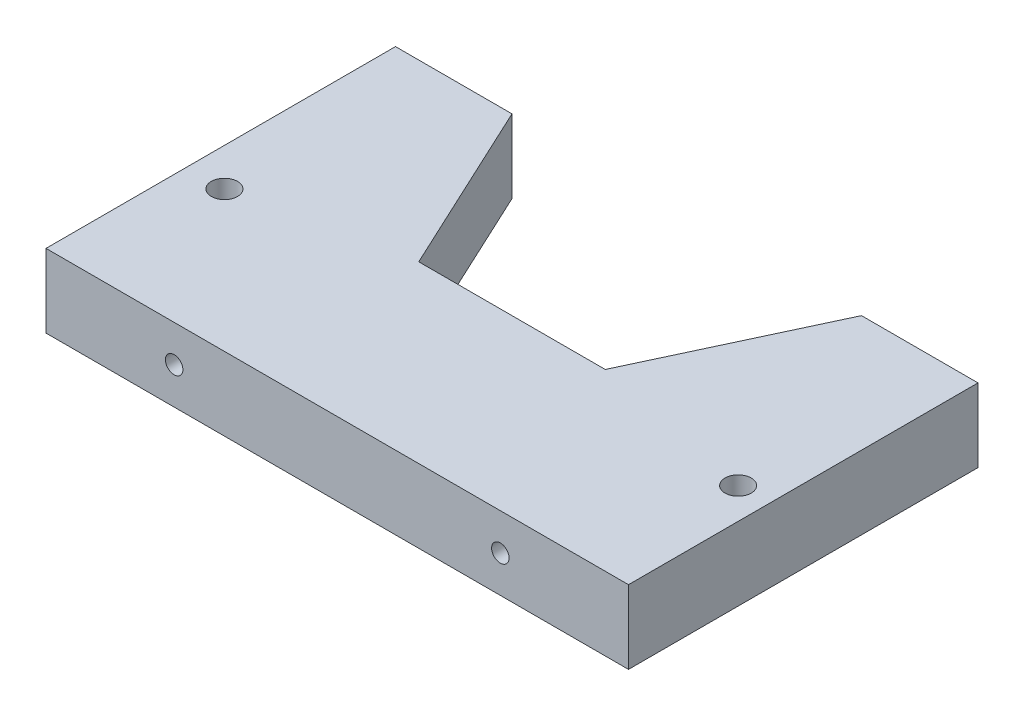
ISO-10303-21;
HEADER;
FILE_DESCRIPTION(('STEP AP214'),'2;1');
FILE_NAME('part.step','',(''),(''),'','','');
FILE_SCHEMA(('AUTOMOTIVE_DESIGN { 1 0 10303 214 1 1 1 1 }'));
ENDSEC;
DATA;
#1=APPLICATION_CONTEXT('core data for automotive mechanical design processes');
#2=APPLICATION_PROTOCOL_DEFINITION('international standard','automotive_design',2000,#1);
#3=PRODUCT_CONTEXT('',#1,'mechanical');
#4=PRODUCT('Part','Part','',(#3));
#5=PRODUCT_RELATED_PRODUCT_CATEGORY('part','',(#4));
#6=PRODUCT_DEFINITION_FORMATION('','',#4);
#7=PRODUCT_DEFINITION_CONTEXT('part definition',#1,'design');
#8=PRODUCT_DEFINITION('design','',#6,#7);
#9=PRODUCT_DEFINITION_SHAPE('','',#8);
#10=(LENGTH_UNIT() NAMED_UNIT(*) SI_UNIT(.MILLI.,.METRE.));
#11=(NAMED_UNIT(*) PLANE_ANGLE_UNIT() SI_UNIT($,.RADIAN.));
#12=(NAMED_UNIT(*) SI_UNIT($,.STERADIAN.) SOLID_ANGLE_UNIT());
#13=UNCERTAINTY_MEASURE_WITH_UNIT(LENGTH_MEASURE(1.E-05),#10,'distance_accuracy_value','');
#14=(GEOMETRIC_REPRESENTATION_CONTEXT(3) GLOBAL_UNCERTAINTY_ASSIGNED_CONTEXT((#13)) GLOBAL_UNIT_ASSIGNED_CONTEXT((#10,
#11,#12)) REPRESENTATION_CONTEXT('',''));
#15=CARTESIAN_POINT('',(0.,0.,0.));
#16=DIRECTION('',(0.,0.,1.));
#17=DIRECTION('',(1.,0.,0.));
#18=AXIS2_PLACEMENT_3D('',#15,#16,#17);
#19=CARTESIAN_POINT('',(50.,12.6,-30.));
#20=DIRECTION('',(-1.,0.,0.));
#21=DIRECTION('',(0.,0.,1.));
#22=AXIS2_PLACEMENT_3D('',#19,#20,#21);
#23=PLANE('',#22);
#24=DIRECTION('',(0.,0.,-1.));
#25=VECTOR('',#24,1.);
#26=CARTESIAN_POINT('',(50.,0.,-30.));
#27=LINE('',#26,#25);
#28=CARTESIAN_POINT('',(50.,0.,30.));
#29=VERTEX_POINT('',#28);
#30=CARTESIAN_POINT('',(50.,0.,-30.));
#31=VERTEX_POINT('',#30);
#32=EDGE_CURVE('E134',#29,#31,#27,.T.);
#33=ORIENTED_EDGE('',*,*,#32,.T.);
#34=DIRECTION('',(0.,-1.,0.));
#35=VECTOR('',#34,1.);
#36=CARTESIAN_POINT('',(50.,12.6,-30.));
#37=LINE('',#36,#35);
#38=CARTESIAN_POINT('',(50.,12.6,-30.));
#39=VERTEX_POINT('',#38);
#40=EDGE_CURVE('E11',#39,#31,#37,.T.);
#41=ORIENTED_EDGE('',*,*,#40,.F.);
#42=DIRECTION('',(0.,0.,-1.));
#43=VECTOR('',#42,1.);
#44=CARTESIAN_POINT('',(50.,12.6,-30.));
#45=LINE('',#44,#43);
#46=CARTESIAN_POINT('',(50.,12.6,30.));
#47=VERTEX_POINT('',#46);
#48=EDGE_CURVE('E149',#47,#39,#45,.T.);
#49=ORIENTED_EDGE('',*,*,#48,.F.);
#50=DIRECTION('',(0.,-1.,0.));
#51=VECTOR('',#50,1.);
#52=CARTESIAN_POINT('',(50.,12.6,30.));
#53=LINE('',#52,#51);
#54=EDGE_CURVE('E130',#47,#29,#53,.T.);
#55=ORIENTED_EDGE('',*,*,#54,.T.);
#56=EDGE_LOOP('',(#33,#41,#49,#55));
#57=FACE_BOUND('',#56,.T.);
#58=ADVANCED_FACE('F38',(#57),#23,.F.);
#59=CARTESIAN_POINT('',(30.,12.6,-30.));
#60=DIRECTION('',(0.,0.,1.));
#61=DIRECTION('',(1.,0.,0.));
#62=AXIS2_PLACEMENT_3D('',#59,#60,#61);
#63=PLANE('',#62);
#64=DIRECTION('',(-1.,0.,0.));
#65=VECTOR('',#64,1.);
#66=CARTESIAN_POINT('',(30.,0.,-30.));
#67=LINE('',#66,#65);
#68=CARTESIAN_POINT('',(30.,0.,-30.));
#69=VERTEX_POINT('',#68);
#70=EDGE_CURVE('E137',#31,#69,#67,.T.);
#71=ORIENTED_EDGE('',*,*,#70,.T.);
#72=DIRECTION('',(0.,-1.,0.));
#73=VECTOR('',#72,1.);
#74=CARTESIAN_POINT('',(30.,12.6,-30.));
#75=LINE('',#74,#73);
#76=CARTESIAN_POINT('',(30.,12.6,-30.));
#77=VERTEX_POINT('',#76);
#78=EDGE_CURVE('E46',#77,#69,#75,.T.);
#79=ORIENTED_EDGE('',*,*,#78,.F.);
#80=DIRECTION('',(-1.,0.,0.));
#81=VECTOR('',#80,1.);
#82=CARTESIAN_POINT('',(30.,12.6,-30.));
#83=LINE('',#82,#81);
#84=EDGE_CURVE('E97',#39,#77,#83,.T.);
#85=ORIENTED_EDGE('',*,*,#84,.F.);
#86=ORIENTED_EDGE('',*,*,#40,.T.);
#87=EDGE_LOOP('',(#71,#79,#85,#86));
#88=FACE_BOUND('',#87,.T.);
#89=ADVANCED_FACE('F230',(#88),#63,.F.);
#90=CARTESIAN_POINT('',(16.0081324904695,12.6,0.));
#91=DIRECTION('',(0.906277263594216,0.,0.422683713303671));
#92=DIRECTION('',(0.422683713303671,0.,-0.906277263594216));
#93=AXIS2_PLACEMENT_3D('',#90,#91,#92);
#94=PLANE('',#93);
#95=DIRECTION('',(-0.422683713303671,0.,0.906277263594216));
#96=VECTOR('',#95,1.);
#97=CARTESIAN_POINT('',(16.0081324904695,0.,0.));
#98=LINE('',#97,#96);
#99=CARTESIAN_POINT('',(16.0081324904695,0.,0.));
#100=VERTEX_POINT('',#99);
#101=EDGE_CURVE('E140',#69,#100,#98,.T.);
#102=ORIENTED_EDGE('',*,*,#101,.T.);
#103=DIRECTION('',(0.,-1.,0.));
#104=VECTOR('',#103,1.);
#105=CARTESIAN_POINT('',(16.0081324904695,12.6,0.));
#106=LINE('',#105,#104);
#107=CARTESIAN_POINT('',(16.0081324904695,12.6,0.));
#108=VERTEX_POINT('',#107);
#109=EDGE_CURVE('E156',#108,#100,#106,.T.);
#110=ORIENTED_EDGE('',*,*,#109,.F.);
#111=DIRECTION('',(-0.422683713303671,0.,0.906277263594216));
#112=VECTOR('',#111,1.);
#113=CARTESIAN_POINT('',(16.0081324904695,12.6,0.));
#114=LINE('',#113,#112);
#115=EDGE_CURVE('E164',#77,#108,#114,.T.);
#116=ORIENTED_EDGE('',*,*,#115,.F.);
#117=ORIENTED_EDGE('',*,*,#78,.T.);
#118=EDGE_LOOP('',(#102,#110,#116,#117));
#119=FACE_BOUND('',#118,.T.);
#120=ADVANCED_FACE('F162',(#119),#94,.F.);
#121=CARTESIAN_POINT('',(-16.0081324904695,12.6,0.));
#122=DIRECTION('',(0.,0.,1.));
#123=DIRECTION('',(1.,0.,0.));
#124=AXIS2_PLACEMENT_3D('',#121,#122,#123);
#125=PLANE('',#124);
#126=DIRECTION('',(-1.,0.,0.));
#127=VECTOR('',#126,1.);
#128=CARTESIAN_POINT('',(-16.0081324904695,0.,0.));
#129=LINE('',#128,#127);
#130=CARTESIAN_POINT('',(-16.0081324904695,0.,0.));
#131=VERTEX_POINT('',#130);
#132=EDGE_CURVE('E142',#100,#131,#129,.T.);
#133=ORIENTED_EDGE('',*,*,#132,.T.);
#134=DIRECTION('',(0.,-1.,0.));
#135=VECTOR('',#134,1.);
#136=CARTESIAN_POINT('',(-16.0081324904695,12.6,0.));
#137=LINE('',#136,#135);
#138=CARTESIAN_POINT('',(-16.0081324904695,12.6,0.));
#139=VERTEX_POINT('',#138);
#140=EDGE_CURVE('E153',#139,#131,#137,.T.);
#141=ORIENTED_EDGE('',*,*,#140,.F.);
#142=DIRECTION('',(-1.,0.,0.));
#143=VECTOR('',#142,1.);
#144=CARTESIAN_POINT('',(-16.0081324904695,12.6,0.));
#145=LINE('',#144,#143);
#146=EDGE_CURVE('E176',#108,#139,#145,.T.);
#147=ORIENTED_EDGE('',*,*,#146,.F.);
#148=ORIENTED_EDGE('',*,*,#109,.T.);
#149=EDGE_LOOP('',(#133,#141,#147,#148));
#150=FACE_BOUND('',#149,.T.);
#151=ADVANCED_FACE('F172',(#150),#125,.F.);
#152=CARTESIAN_POINT('',(-30.,12.6,-30.));
#153=DIRECTION('',(-0.906277263594216,0.,0.422683713303671));
#154=DIRECTION('',(0.422683713303671,0.,0.906277263594216));
#155=AXIS2_PLACEMENT_3D('',#152,#153,#154);
#156=PLANE('',#155);
#157=DIRECTION('',(-0.422683713303671,0.,-0.906277263594216));
#158=VECTOR('',#157,1.);
#159=CARTESIAN_POINT('',(-30.,0.,-30.));
#160=LINE('',#159,#158);
#161=CARTESIAN_POINT('',(-30.,0.,-30.));
#162=VERTEX_POINT('',#161);
#163=EDGE_CURVE('E144',#131,#162,#160,.T.);
#164=ORIENTED_EDGE('',*,*,#163,.T.);
#165=DIRECTION('',(0.,-1.,0.));
#166=VECTOR('',#165,1.);
#167=CARTESIAN_POINT('',(-30.,12.6,-30.));
#168=LINE('',#167,#166);
#169=CARTESIAN_POINT('',(-30.,12.6,-30.));
#170=VERTEX_POINT('',#169);
#171=EDGE_CURVE('E125',#170,#162,#168,.T.);
#172=ORIENTED_EDGE('',*,*,#171,.F.);
#173=DIRECTION('',(-0.422683713303671,0.,-0.906277263594216));
#174=VECTOR('',#173,1.);
#175=CARTESIAN_POINT('',(-30.,12.6,-30.));
#176=LINE('',#175,#174);
#177=EDGE_CURVE('E116',#139,#170,#176,.T.);
#178=ORIENTED_EDGE('',*,*,#177,.F.);
#179=ORIENTED_EDGE('',*,*,#140,.T.);
#180=EDGE_LOOP('',(#164,#172,#178,#179));
#181=FACE_BOUND('',#180,.T.);
#182=ADVANCED_FACE('F175',(#181),#156,.F.);
#183=CARTESIAN_POINT('',(-50.,12.6,-30.));
#184=DIRECTION('',(0.,0.,1.));
#185=DIRECTION('',(1.,0.,0.));
#186=AXIS2_PLACEMENT_3D('',#183,#184,#185);
#187=PLANE('',#186);
#188=DIRECTION('',(-1.,0.,0.));
#189=VECTOR('',#188,1.);
#190=CARTESIAN_POINT('',(-50.,0.,-30.));
#191=LINE('',#190,#189);
#192=CARTESIAN_POINT('',(-50.,0.,-30.));
#193=VERTEX_POINT('',#192);
#194=EDGE_CURVE('E124',#162,#193,#191,.T.);
#195=ORIENTED_EDGE('',*,*,#194,.T.);
#196=DIRECTION('',(0.,-1.,0.));
#197=VECTOR('',#196,1.);
#198=CARTESIAN_POINT('',(-50.,12.6,-30.));
#199=LINE('',#198,#197);
#200=CARTESIAN_POINT('',(-50.,12.6,-30.));
#201=VERTEX_POINT('',#200);
#202=EDGE_CURVE('E121',#201,#193,#199,.T.);
#203=ORIENTED_EDGE('',*,*,#202,.F.);
#204=DIRECTION('',(-1.,0.,0.));
#205=VECTOR('',#204,1.);
#206=CARTESIAN_POINT('',(-50.,12.6,-30.));
#207=LINE('',#206,#205);
#208=EDGE_CURVE('E110',#170,#201,#207,.T.);
#209=ORIENTED_EDGE('',*,*,#208,.F.);
#210=ORIENTED_EDGE('',*,*,#171,.T.);
#211=EDGE_LOOP('',(#195,#203,#209,#210));
#212=FACE_BOUND('',#211,.T.);
#213=ADVANCED_FACE('F122',(#212),#187,.F.);
#214=CARTESIAN_POINT('',(-50.,12.6,-30.));
#215=DIRECTION('',(1.,0.,0.));
#216=DIRECTION('',(0.,0.,-1.));
#217=AXIS2_PLACEMENT_3D('',#214,#215,#216);
#218=PLANE('',#217);
#219=DIRECTION('',(0.,0.,1.));
#220=VECTOR('',#219,1.);
#221=CARTESIAN_POINT('',(-50.,0.,-30.));
#222=LINE('',#221,#220);
#223=CARTESIAN_POINT('',(-50.,0.,30.));
#224=VERTEX_POINT('',#223);
#225=EDGE_CURVE('E83',#193,#224,#222,.T.);
#226=ORIENTED_EDGE('',*,*,#225,.T.);
#227=DIRECTION('',(0.,-1.,0.));
#228=VECTOR('',#227,1.);
#229=CARTESIAN_POINT('',(-50.,12.6,30.));
#230=LINE('',#229,#228);
#231=CARTESIAN_POINT('',(-50.,12.6,30.));
#232=VERTEX_POINT('',#231);
#233=EDGE_CURVE('E126',#232,#224,#230,.T.);
#234=ORIENTED_EDGE('',*,*,#233,.F.);
#235=DIRECTION('',(0.,0.,1.));
#236=VECTOR('',#235,1.);
#237=CARTESIAN_POINT('',(-50.,12.6,-30.));
#238=LINE('',#237,#236);
#239=EDGE_CURVE('E114',#201,#232,#238,.T.);
#240=ORIENTED_EDGE('',*,*,#239,.F.);
#241=ORIENTED_EDGE('',*,*,#202,.T.);
#242=EDGE_LOOP('',(#226,#234,#240,#241));
#243=FACE_BOUND('',#242,.T.);
#244=ADVANCED_FACE('F128',(#243),#218,.F.);
#245=CARTESIAN_POINT('',(-50.,12.6,30.));
#246=DIRECTION('',(0.,0.,-1.));
#247=DIRECTION('',(-1.,0.,0.));
#248=AXIS2_PLACEMENT_3D('',#245,#246,#247);
#249=PLANE('',#248);
#250=CARTESIAN_POINT('',(-28.,6.3,30.));
#251=DIRECTION('',(0.,0.,1.));
#252=DIRECTION('',(1.,0.,0.));
#253=AXIS2_PLACEMENT_3D('',#250,#251,#252);
#254=CIRCLE('',#253,1.5);
#255=CARTESIAN_POINT('',(-26.5,6.3,30.));
#256=VERTEX_POINT('',#255);
#257=EDGE_CURVE('E189',#256,#256,#254,.T.);
#258=ORIENTED_EDGE('',*,*,#257,.F.);
#259=EDGE_LOOP('',(#258));
#260=FACE_BOUND('',#259,.T.);
#261=CARTESIAN_POINT('',(28.,6.3,30.));
#262=DIRECTION('',(0.,0.,1.));
#263=DIRECTION('',(1.,0.,0.));
#264=AXIS2_PLACEMENT_3D('',#261,#262,#263);
#265=CIRCLE('',#264,1.5);
#266=CARTESIAN_POINT('',(29.5,6.3,30.));
#267=VERTEX_POINT('',#266);
#268=EDGE_CURVE('E182',#267,#267,#265,.T.);
#269=ORIENTED_EDGE('',*,*,#268,.F.);
#270=EDGE_LOOP('',(#269));
#271=FACE_BOUND('',#270,.T.);
#272=DIRECTION('',(1.,0.,0.));
#273=VECTOR('',#272,1.);
#274=CARTESIAN_POINT('',(-50.,0.,30.));
#275=LINE('',#274,#273);
#276=EDGE_CURVE('E89',#224,#29,#275,.T.);
#277=ORIENTED_EDGE('',*,*,#276,.T.);
#278=ORIENTED_EDGE('',*,*,#54,.F.);
#279=DIRECTION('',(1.,0.,0.));
#280=VECTOR('',#279,1.);
#281=CARTESIAN_POINT('',(-50.,12.6,30.));
#282=LINE('',#281,#280);
#283=EDGE_CURVE('E54',#232,#47,#282,.T.);
#284=ORIENTED_EDGE('',*,*,#283,.F.);
#285=ORIENTED_EDGE('',*,*,#233,.T.);
#286=EDGE_LOOP('',(#277,#278,#284,#285));
#287=FACE_BOUND('',#286,.T.);
#288=ADVANCED_FACE('F237',(#260,#271,#287),#249,.F.);
#289=CARTESIAN_POINT('',(0.,12.6,0.));
#290=DIRECTION('',(0.,1.,0.));
#291=DIRECTION('',(0.,0.,1.));
#292=AXIS2_PLACEMENT_3D('',#289,#290,#291);
#293=PLANE('',#292);
#294=CARTESIAN_POINT('',(44.6718413025261,12.6,5.8511375398662));
#295=DIRECTION('',(0.,1.,0.));
#296=DIRECTION('',(0.,0.,1.));
#297=AXIS2_PLACEMENT_3D('',#294,#295,#296);
#298=CIRCLE('',#297,2.25);
#299=CARTESIAN_POINT('',(44.6718413025261,12.6,8.1011375398662));
#300=VERTEX_POINT('',#299);
#301=EDGE_CURVE('E200',#300,#300,#298,.F.);
#302=ORIENTED_EDGE('',*,*,#301,.T.);
#303=EDGE_LOOP('',(#302));
#304=FACE_BOUND('',#303,.T.);
#305=CARTESIAN_POINT('',(-43.5196267759935,12.6,5.85113753986622));
#306=DIRECTION('',(0.,1.,0.));
#307=DIRECTION('',(0.,0.,1.));
#308=AXIS2_PLACEMENT_3D('',#305,#306,#307);
#309=CIRCLE('',#308,2.25);
#310=CARTESIAN_POINT('',(-43.5196267759935,12.6,8.10113753986622));
#311=VERTEX_POINT('',#310);
#312=EDGE_CURVE('E194',#311,#311,#309,.F.);
#313=ORIENTED_EDGE('',*,*,#312,.T.);
#314=EDGE_LOOP('',(#313));
#315=FACE_BOUND('',#314,.T.);
#316=ORIENTED_EDGE('',*,*,#48,.T.);
#317=ORIENTED_EDGE('',*,*,#84,.T.);
#318=ORIENTED_EDGE('',*,*,#115,.T.);
#319=ORIENTED_EDGE('',*,*,#146,.T.);
#320=ORIENTED_EDGE('',*,*,#177,.T.);
#321=ORIENTED_EDGE('',*,*,#208,.T.);
#322=ORIENTED_EDGE('',*,*,#239,.T.);
#323=ORIENTED_EDGE('',*,*,#283,.T.);
#324=EDGE_LOOP('',(#316,#317,#318,#319,#320,#321,#322,#323));
#325=FACE_BOUND('',#324,.T.);
#326=ADVANCED_FACE('F112',(#304,#315,#325),#293,.T.);
#327=CARTESIAN_POINT('',(0.,0.,0.));
#328=DIRECTION('',(0.,1.,0.));
#329=DIRECTION('',(0.,0.,1.));
#330=AXIS2_PLACEMENT_3D('',#327,#328,#329);
#331=PLANE('',#330);
#332=CARTESIAN_POINT('',(44.6718413025261,0.,5.8511375398662));
#333=DIRECTION('',(0.,-1.,0.));
#334=DIRECTION('',(0.,0.,-1.));
#335=AXIS2_PLACEMENT_3D('',#332,#333,#334);
#336=CIRCLE('',#335,2.25);
#337=CARTESIAN_POINT('',(44.6718413025261,0.,3.6011375398662));
#338=VERTEX_POINT('',#337);
#339=EDGE_CURVE('E186',#338,#338,#336,.T.);
#340=ORIENTED_EDGE('',*,*,#339,.F.);
#341=EDGE_LOOP('',(#340));
#342=FACE_BOUND('',#341,.T.);
#343=CARTESIAN_POINT('',(-43.5196267759935,0.,5.85113753986622));
#344=DIRECTION('',(0.,-1.,0.));
#345=DIRECTION('',(0.,0.,-1.));
#346=AXIS2_PLACEMENT_3D('',#343,#344,#345);
#347=CIRCLE('',#346,2.25);
#348=CARTESIAN_POINT('',(-43.5196267759935,0.,3.60113753986621));
#349=VERTEX_POINT('',#348);
#350=EDGE_CURVE('E197',#349,#349,#347,.T.);
#351=ORIENTED_EDGE('',*,*,#350,.F.);
#352=EDGE_LOOP('',(#351));
#353=FACE_BOUND('',#352,.T.);
#354=ORIENTED_EDGE('',*,*,#32,.F.);
#355=ORIENTED_EDGE('',*,*,#276,.F.);
#356=ORIENTED_EDGE('',*,*,#225,.F.);
#357=ORIENTED_EDGE('',*,*,#194,.F.);
#358=ORIENTED_EDGE('',*,*,#163,.F.);
#359=ORIENTED_EDGE('',*,*,#132,.F.);
#360=ORIENTED_EDGE('',*,*,#101,.F.);
#361=ORIENTED_EDGE('',*,*,#70,.F.);
#362=EDGE_LOOP('',(#354,#355,#356,#357,#358,#359,#360,#361));
#363=FACE_BOUND('',#362,.T.);
#364=ADVANCED_FACE('F168',(#342,#353,#363),#331,.F.);
#365=CARTESIAN_POINT('',(28.,6.3,10.));
#366=DIRECTION('',(0.,0.,1.));
#367=DIRECTION('',(1.,0.,0.));
#368=AXIS2_PLACEMENT_3D('',#365,#366,#367);
#369=CYLINDRICAL_SURFACE('',#368,1.5);
#370=CARTESIAN_POINT('',(28.,6.3,10.));
#371=DIRECTION('',(0.,0.,1.));
#372=DIRECTION('',(1.,0.,0.));
#373=AXIS2_PLACEMENT_3D('',#370,#371,#372);
#374=CIRCLE('',#373,1.5);
#375=CARTESIAN_POINT('',(29.5,6.3,10.));
#376=VERTEX_POINT('',#375);
#377=EDGE_CURVE('E185',#376,#376,#374,.T.);
#378=ORIENTED_EDGE('',*,*,#377,.F.);
#379=EDGE_LOOP('',(#378));
#380=FACE_BOUND('',#379,.T.);
#381=ORIENTED_EDGE('',*,*,#268,.T.);
#382=EDGE_LOOP('',(#381));
#383=FACE_BOUND('',#382,.T.);
#384=ADVANCED_FACE('F210',(#380,#383),#369,.F.);
#385=CARTESIAN_POINT('',(28.,6.3,10.));
#386=DIRECTION('',(0.,0.,1.));
#387=DIRECTION('',(1.,0.,0.));
#388=AXIS2_PLACEMENT_3D('',#385,#386,#387);
#389=PLANE('',#388);
#390=ORIENTED_EDGE('',*,*,#377,.T.);
#391=EDGE_LOOP('',(#390));
#392=FACE_BOUND('',#391,.T.);
#393=ADVANCED_FACE('F293',(#392),#389,.T.);
#394=CARTESIAN_POINT('',(-28.,6.3,10.));
#395=DIRECTION('',(0.,0.,1.));
#396=DIRECTION('',(1.,0.,0.));
#397=AXIS2_PLACEMENT_3D('',#394,#395,#396);
#398=CYLINDRICAL_SURFACE('',#397,1.5);
#399=CARTESIAN_POINT('',(-28.,6.3,10.));
#400=DIRECTION('',(0.,0.,1.));
#401=DIRECTION('',(1.,0.,0.));
#402=AXIS2_PLACEMENT_3D('',#399,#400,#401);
#403=CIRCLE('',#402,1.5);
#404=CARTESIAN_POINT('',(-26.5,6.3,10.));
#405=VERTEX_POINT('',#404);
#406=EDGE_CURVE('E138',#405,#405,#403,.T.);
#407=ORIENTED_EDGE('',*,*,#406,.F.);
#408=EDGE_LOOP('',(#407));
#409=FACE_BOUND('',#408,.T.);
#410=ORIENTED_EDGE('',*,*,#257,.T.);
#411=EDGE_LOOP('',(#410));
#412=FACE_BOUND('',#411,.T.);
#413=ADVANCED_FACE('F225',(#409,#412),#398,.F.);
#414=CARTESIAN_POINT('',(-28.,6.3,10.));
#415=DIRECTION('',(0.,0.,1.));
#416=DIRECTION('',(1.,0.,0.));
#417=AXIS2_PLACEMENT_3D('',#414,#415,#416);
#418=PLANE('',#417);
#419=ORIENTED_EDGE('',*,*,#406,.T.);
#420=EDGE_LOOP('',(#419));
#421=FACE_BOUND('',#420,.T.);
#422=ADVANCED_FACE('F216',(#421),#418,.T.);
#423=CARTESIAN_POINT('',(-43.5196267759935,12.601,5.85113753986622));
#424=DIRECTION('',(0.,-1.,0.));
#425=DIRECTION('',(0.,0.,-1.));
#426=AXIS2_PLACEMENT_3D('',#423,#424,#425);
#427=CYLINDRICAL_SURFACE('',#426,2.25);
#428=ORIENTED_EDGE('',*,*,#312,.F.);
#429=EDGE_LOOP('',(#428));
#430=FACE_BOUND('',#429,.T.);
#431=ORIENTED_EDGE('',*,*,#350,.T.);
#432=EDGE_LOOP('',(#431));
#433=FACE_BOUND('',#432,.T.);
#434=ADVANCED_FACE('F214',(#430,#433),#427,.F.);
#435=CARTESIAN_POINT('',(44.6718413025261,12.601,5.8511375398662));
#436=DIRECTION('',(0.,-1.,0.));
#437=DIRECTION('',(0.,0.,-1.));
#438=AXIS2_PLACEMENT_3D('',#435,#436,#437);
#439=CYLINDRICAL_SURFACE('',#438,2.25);
#440=ORIENTED_EDGE('',*,*,#301,.F.);
#441=EDGE_LOOP('',(#440));
#442=FACE_BOUND('',#441,.T.);
#443=ORIENTED_EDGE('',*,*,#339,.T.);
#444=EDGE_LOOP('',(#443));
#445=FACE_BOUND('',#444,.T.);
#446=ADVANCED_FACE('F206',(#442,#445),#439,.F.);
#447=CLOSED_SHELL('',(#58,#89,#120,#151,#182,#213,#244,#288,#326,#364,#384,#393,#413,#422,#434,#446));
#448=MANIFOLD_SOLID_BREP('B2',#447);
#449=ADVANCED_BREP_SHAPE_REPRESENTATION('',(#18,#448),#14);
#450=SHAPE_DEFINITION_REPRESENTATION(#9,#449);
ENDSEC;
END-ISO-10303-21;
